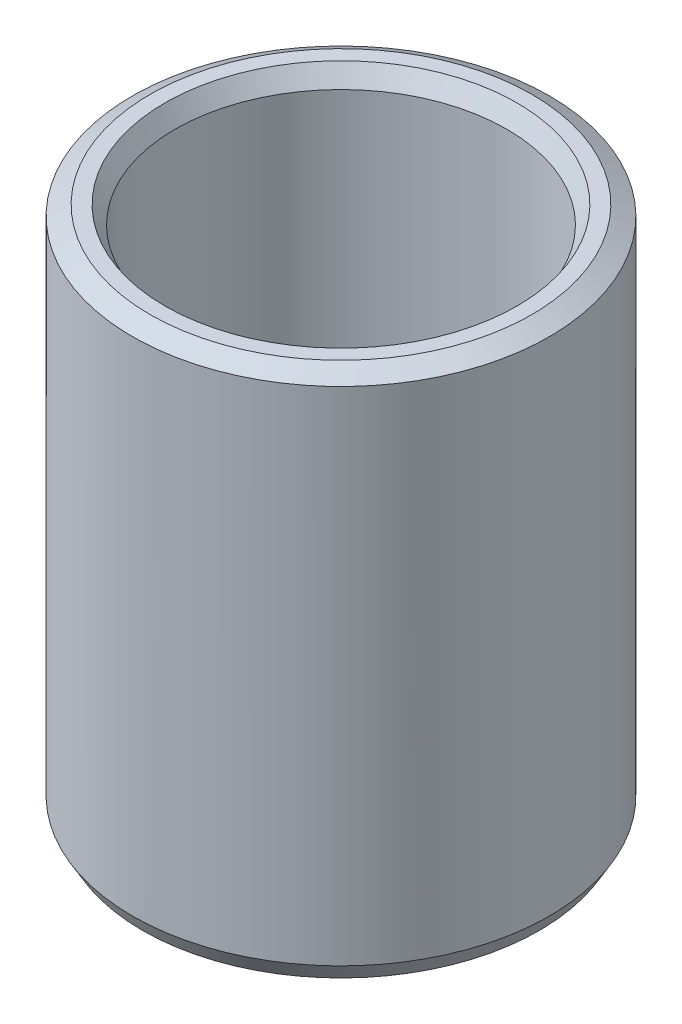
ISO-10303-21;
HEADER;
FILE_DESCRIPTION(('STEP AP214'),'2;1');
FILE_NAME('part.step','',(''),(''),'','','');
FILE_SCHEMA(('AUTOMOTIVE_DESIGN { 1 0 10303 214 1 1 1 1 }'));
ENDSEC;
DATA;
#1=APPLICATION_CONTEXT('core data for automotive mechanical design processes');
#2=APPLICATION_PROTOCOL_DEFINITION('international standard','automotive_design',2000,#1);
#3=PRODUCT_CONTEXT('',#1,'mechanical');
#4=PRODUCT('Part','Part','',(#3));
#5=PRODUCT_RELATED_PRODUCT_CATEGORY('part','',(#4));
#6=PRODUCT_DEFINITION_FORMATION('','',#4);
#7=PRODUCT_DEFINITION_CONTEXT('part definition',#1,'design');
#8=PRODUCT_DEFINITION('design','',#6,#7);
#9=PRODUCT_DEFINITION_SHAPE('','',#8);
#10=(LENGTH_UNIT() NAMED_UNIT(*) SI_UNIT(.MILLI.,.METRE.));
#11=(NAMED_UNIT(*) PLANE_ANGLE_UNIT() SI_UNIT($,.RADIAN.));
#12=(NAMED_UNIT(*) SI_UNIT($,.STERADIAN.) SOLID_ANGLE_UNIT());
#13=UNCERTAINTY_MEASURE_WITH_UNIT(LENGTH_MEASURE(1.E-05),#10,'distance_accuracy_value','');
#14=(GEOMETRIC_REPRESENTATION_CONTEXT(3) GLOBAL_UNCERTAINTY_ASSIGNED_CONTEXT((#13)) GLOBAL_UNIT_ASSIGNED_CONTEXT((#10,
#11,#12)) REPRESENTATION_CONTEXT('',''));
#15=CARTESIAN_POINT('',(0.,0.,0.));
#16=DIRECTION('',(0.,0.,1.));
#17=DIRECTION('',(1.,0.,0.));
#18=AXIS2_PLACEMENT_3D('',#15,#16,#17);
#19=CARTESIAN_POINT('',(0.,114.304376309093,0.));
#20=DIRECTION('',(0.,-1.,0.));
#21=DIRECTION('',(0.,0.,-1.));
#22=AXIS2_PLACEMENT_3D('',#19,#20,#21);
#23=CYLINDRICAL_SURFACE('',#22,45.);
#24=CARTESIAN_POINT('',(0.,3.8169350454051,0.));
#25=DIRECTION('',(0.,1.,0.));
#26=DIRECTION('',(0.,0.,1.));
#27=AXIS2_PLACEMENT_3D('',#24,#25,#26);
#28=CIRCLE('',#27,45.);
#29=CARTESIAN_POINT('',(0.,3.8169350454051,45.));
#30=VERTEX_POINT('',#29);
#31=EDGE_CURVE('E10',#30,#30,#28,.T.);
#32=ORIENTED_EDGE('',*,*,#31,.T.);
#33=EDGE_LOOP('',(#32));
#34=FACE_BOUND('',#33,.T.);
#35=CARTESIAN_POINT('',(0.,112.100667833149,0.));
#36=DIRECTION('',(0.,1.,0.));
#37=DIRECTION('',(0.,0.,1.));
#38=AXIS2_PLACEMENT_3D('',#35,#36,#37);
#39=CIRCLE('',#38,45.);
#40=CARTESIAN_POINT('',(0.,112.100667833149,-45.));
#41=VERTEX_POINT('',#40);
#42=EDGE_CURVE('E50',#41,#41,#39,.F.);
#43=ORIENTED_EDGE('',*,*,#42,.T.);
#44=EDGE_LOOP('',(#43));
#45=FACE_BOUND('',#44,.T.);
#46=ADVANCED_FACE('F39',(#34,#45),#23,.T.);
#47=CARTESIAN_POINT('',(0.,114.304376309093,0.));
#48=DIRECTION('',(0.,1.,0.));
#49=DIRECTION('',(0.,0.,1.));
#50=AXIS2_PLACEMENT_3D('',#47,#48,#49);
#51=PLANE('',#50);
#52=CARTESIAN_POINT('',(0.,114.304376309093,0.));
#53=DIRECTION('',(0.,1.,0.));
#54=DIRECTION('',(0.,0.,1.));
#55=AXIS2_PLACEMENT_3D('',#52,#53,#54);
#56=CIRCLE('',#55,37.9833884102577);
#57=CARTESIAN_POINT('',(0.,114.304376309093,37.9833884102577));
#58=VERTEX_POINT('',#57);
#59=EDGE_CURVE('E58',#58,#58,#56,.F.);
#60=ORIENTED_EDGE('',*,*,#59,.T.);
#61=EDGE_LOOP('',(#60));
#62=FACE_BOUND('',#61,.T.);
#63=CARTESIAN_POINT('',(0.,114.304376309093,0.));
#64=DIRECTION('',(0.,1.,0.));
#65=DIRECTION('',(0.,0.,1.));
#66=AXIS2_PLACEMENT_3D('',#63,#64,#65);
#67=CIRCLE('',#66,41.1830649545949);
#68=CARTESIAN_POINT('',(0.,114.304376309093,-41.1830649545949));
#69=VERTEX_POINT('',#68);
#70=EDGE_CURVE('E61',#69,#69,#67,.T.);
#71=ORIENTED_EDGE('',*,*,#70,.T.);
#72=EDGE_LOOP('',(#71));
#73=FACE_BOUND('',#72,.T.);
#74=ADVANCED_FACE('F88',(#62,#73),#51,.T.);
#75=CARTESIAN_POINT('',(0.,0.,0.));
#76=DIRECTION('',(0.,1.,0.));
#77=DIRECTION('',(0.,0.,1.));
#78=AXIS2_PLACEMENT_3D('',#75,#76,#77);
#79=PLANE('',#78);
#80=CARTESIAN_POINT('',(0.,0.,0.));
#81=DIRECTION('',(0.,1.,0.));
#82=DIRECTION('',(0.,0.,1.));
#83=AXIS2_PLACEMENT_3D('',#80,#81,#82);
#84=CIRCLE('',#83,39.5966149797188);
#85=CARTESIAN_POINT('',(0.,0.,39.5966149797188));
#86=VERTEX_POINT('',#85);
#87=EDGE_CURVE('E51',#86,#86,#84,.T.);
#88=ORIENTED_EDGE('',*,*,#87,.T.);
#89=EDGE_LOOP('',(#88));
#90=FACE_BOUND('',#89,.T.);
#91=CARTESIAN_POINT('',(0.,0.,0.));
#92=DIRECTION('',(0.,1.,0.));
#93=DIRECTION('',(0.,0.,1.));
#94=AXIS2_PLACEMENT_3D('',#91,#92,#93);
#95=CIRCLE('',#94,42.796291524056);
#96=CARTESIAN_POINT('',(0.,0.,42.796291524056));
#97=VERTEX_POINT('',#96);
#98=EDGE_CURVE('E54',#97,#97,#95,.F.);
#99=ORIENTED_EDGE('',*,*,#98,.T.);
#100=EDGE_LOOP('',(#99));
#101=FACE_BOUND('',#100,.T.);
#102=ADVANCED_FACE('F83',(#90,#101),#79,.F.);
#103=CARTESIAN_POINT('',(0.,114.304376309093,0.));
#104=DIRECTION('',(0.,-1.,0.));
#105=DIRECTION('',(0.,0.,-1.));
#106=AXIS2_PLACEMENT_3D('',#103,#104,#105);
#107=CYLINDRICAL_SURFACE('',#106,35.7796799343137);
#108=CARTESIAN_POINT('',(0.,110.487441263688,0.));
#109=DIRECTION('',(0.,1.,0.));
#110=DIRECTION('',(0.,0.,1.));
#111=AXIS2_PLACEMENT_3D('',#108,#109,#110);
#112=CIRCLE('',#111,35.7796799343137);
#113=CARTESIAN_POINT('',(0.,110.487441263688,35.7796799343137));
#114=VERTEX_POINT('',#113);
#115=EDGE_CURVE('E67',#114,#114,#112,.T.);
#116=ORIENTED_EDGE('',*,*,#115,.T.);
#117=EDGE_LOOP('',(#116));
#118=FACE_BOUND('',#117,.T.);
#119=CARTESIAN_POINT('',(0.,2.20370847594395,0.));
#120=DIRECTION('',(0.,1.,0.));
#121=DIRECTION('',(0.,0.,1.));
#122=AXIS2_PLACEMENT_3D('',#119,#120,#121);
#123=CIRCLE('',#122,35.7796799343137);
#124=CARTESIAN_POINT('',(0.,2.20370847594395,35.7796799343137));
#125=VERTEX_POINT('',#124);
#126=EDGE_CURVE('E69',#125,#125,#123,.F.);
#127=ORIENTED_EDGE('',*,*,#126,.T.);
#128=EDGE_LOOP('',(#127));
#129=FACE_BOUND('',#128,.T.);
#130=ADVANCED_FACE('F71',(#118,#129),#107,.F.);
#131=CARTESIAN_POINT('',(0.,110.487441263688,0.));
#132=DIRECTION('',(0.,1.,0.));
#133=DIRECTION('',(0.,0.,1.));
#134=AXIS2_PLACEMENT_3D('',#131,#132,#133);
#135=CONICAL_SURFACE('',#134,35.7796799343137,0.523598775598309);
#136=ORIENTED_EDGE('',*,*,#59,.F.);
#137=EDGE_LOOP('',(#136));
#138=FACE_BOUND('',#137,.T.);
#139=ORIENTED_EDGE('',*,*,#115,.F.);
#140=EDGE_LOOP('',(#139));
#141=FACE_BOUND('',#140,.T.);
#142=ADVANCED_FACE('F77',(#138,#141),#135,.F.);
#143=CARTESIAN_POINT('',(0.,0.,0.));
#144=DIRECTION('',(0.,-1.,0.));
#145=DIRECTION('',(0.,0.,-1.));
#146=AXIS2_PLACEMENT_3D('',#143,#144,#145);
#147=CONICAL_SURFACE('',#146,39.5966149797188,1.0471975511966);
#148=ORIENTED_EDGE('',*,*,#126,.F.);
#149=EDGE_LOOP('',(#148));
#150=FACE_BOUND('',#149,.T.);
#151=ORIENTED_EDGE('',*,*,#87,.F.);
#152=EDGE_LOOP('',(#151));
#153=FACE_BOUND('',#152,.T.);
#154=ADVANCED_FACE('F73',(#150,#153),#147,.F.);
#155=CARTESIAN_POINT('',(0.,3.8169350454051,0.));
#156=DIRECTION('',(0.,1.,0.));
#157=DIRECTION('',(0.,0.,1.));
#158=AXIS2_PLACEMENT_3D('',#155,#156,#157);
#159=CONICAL_SURFACE('',#158,45.,0.523598775598301);
#160=ORIENTED_EDGE('',*,*,#98,.F.);
#161=EDGE_LOOP('',(#160));
#162=FACE_BOUND('',#161,.T.);
#163=ORIENTED_EDGE('',*,*,#31,.F.);
#164=EDGE_LOOP('',(#163));
#165=FACE_BOUND('',#164,.T.);
#166=ADVANCED_FACE('F76',(#162,#165),#159,.T.);
#167=CARTESIAN_POINT('',(0.,114.304376309093,0.));
#168=DIRECTION('',(0.,-1.,0.));
#169=DIRECTION('',(0.,0.,-1.));
#170=AXIS2_PLACEMENT_3D('',#167,#168,#169);
#171=CONICAL_SURFACE('',#170,41.1830649545949,1.0471975511966);
#172=CARTESIAN_POINT('',(0.,112.100667833149,-45.));
#173=CARTESIAN_POINT('',(0.,112.123623129774,-44.9602402599437));
#174=CARTESIAN_POINT('',(0.,112.146578426398,-44.9204805198874));
#175=CARTESIAN_POINT('',(0.,112.192489019647,-44.8409610397748));
#176=CARTESIAN_POINT('',(0.,112.215444316271,-44.8012012997185));
#177=CARTESIAN_POINT('',(0.,112.26135490952,-44.7216818196059));
#178=CARTESIAN_POINT('',(0.,112.284310206145,-44.6819220795496));
#179=CARTESIAN_POINT('',(0.,112.330220799394,-44.602402599437));
#180=CARTESIAN_POINT('',(0.,112.353176096018,-44.5626428593807));
#181=CARTESIAN_POINT('',(0.,112.399086689267,-44.4831233792681));
#182=CARTESIAN_POINT('',(0.,112.422041985891,-44.4433636392118));
#183=CARTESIAN_POINT('',(0.,112.46795257914,-44.3638441590992));
#184=CARTESIAN_POINT('',(0.,112.490907875764,-44.3240844190429));
#185=CARTESIAN_POINT('',(0.,112.536818469013,-44.2445649389303));
#186=CARTESIAN_POINT('',(0.,112.559773765638,-44.2048051988739));
#187=CARTESIAN_POINT('',(0.,112.605684358887,-44.1252857187613));
#188=CARTESIAN_POINT('',(0.,112.628639655511,-44.085525978705));
#189=CARTESIAN_POINT('',(0.,112.67455024876,-44.0060064985924));
#190=CARTESIAN_POINT('',(0.,112.697505545384,-43.9662467585361));
#191=CARTESIAN_POINT('',(0.,112.743416138633,-43.8867272784235));
#192=CARTESIAN_POINT('',(0.,112.766371435257,-43.8469675383672));
#193=CARTESIAN_POINT('',(0.,112.812282028506,-43.7674480582546));
#194=CARTESIAN_POINT('',(0.,112.835237325131,-43.7276883181983));
#195=CARTESIAN_POINT('',(0.,112.88114791838,-43.6481688380857));
#196=CARTESIAN_POINT('',(0.,112.904103215004,-43.6084090980294));
#197=CARTESIAN_POINT('',(0.,112.950013808253,-43.5288896179168));
#198=CARTESIAN_POINT('',(0.,112.972969104877,-43.4891298778605));
#199=CARTESIAN_POINT('',(0.,113.018879698126,-43.4096103977479));
#200=CARTESIAN_POINT('',(0.,113.04183499475,-43.3698506576916));
#201=CARTESIAN_POINT('',(0.,113.087745587999,-43.290331177579));
#202=CARTESIAN_POINT('',(0.,113.110700884624,-43.2505714375227));
#203=CARTESIAN_POINT('',(0.,113.156611477873,-43.1710519574101));
#204=CARTESIAN_POINT('',(0.,113.179566774497,-43.1312922173538));
#205=CARTESIAN_POINT('',(0.,113.225477367746,-43.0517727372412));
#206=CARTESIAN_POINT('',(0.,113.24843266437,-43.0120129971849));
#207=CARTESIAN_POINT('',(0.,113.294343257619,-42.9324935170723));
#208=CARTESIAN_POINT('',(0.,113.317298554243,-42.8927337770159));
#209=CARTESIAN_POINT('',(0.,113.363209147492,-42.8132142969033));
#210=CARTESIAN_POINT('',(0.,113.386164444117,-42.773454556847));
#211=CARTESIAN_POINT('',(0.,113.432075037366,-42.6939350767344));
#212=CARTESIAN_POINT('',(0.,113.45503033399,-42.6541753366781));
#213=CARTESIAN_POINT('',(0.,113.500940927239,-42.5746558565655));
#214=CARTESIAN_POINT('',(0.,113.523896223863,-42.5348961165092));
#215=CARTESIAN_POINT('',(0.,113.569806817112,-42.4553766363966));
#216=CARTESIAN_POINT('',(0.,113.592762113736,-42.4156168963403));
#217=CARTESIAN_POINT('',(0.,113.638672706985,-42.3360974162277));
#218=CARTESIAN_POINT('',(0.,113.66162800361,-42.2963376761714));
#219=CARTESIAN_POINT('',(0.,113.707538596858,-42.2168181960588));
#220=CARTESIAN_POINT('',(0.,113.730493893483,-42.1770584560025));
#221=CARTESIAN_POINT('',(0.,113.776404486732,-42.0975389758899));
#222=CARTESIAN_POINT('',(0.,113.799359783356,-42.0577792358336));
#223=CARTESIAN_POINT('',(0.,113.845270376605,-41.978259755721));
#224=CARTESIAN_POINT('',(0.,113.868225673229,-41.9385000156647));
#225=CARTESIAN_POINT('',(0.,113.914136266478,-41.8589805355521));
#226=CARTESIAN_POINT('',(0.,113.937091563103,-41.8192207954958));
#227=CARTESIAN_POINT('',(0.,113.983002156352,-41.7397013153832));
#228=CARTESIAN_POINT('',(0.,114.005957452976,-41.6999415753268));
#229=CARTESIAN_POINT('',(0.,114.051868046225,-41.6204220952142));
#230=CARTESIAN_POINT('',(0.,114.074823342849,-41.5806623551579));
#231=CARTESIAN_POINT('',(0.,114.120733936098,-41.5011428750453));
#232=CARTESIAN_POINT('',(0.,114.143689232722,-41.461383134989));
#233=CARTESIAN_POINT('',(0.,114.189599825971,-41.3818636548764));
#234=CARTESIAN_POINT('',(0.,114.212555122596,-41.3421039148201));
#235=CARTESIAN_POINT('',(0.,114.258465715844,-41.2625844347075));
#236=CARTESIAN_POINT('',(0.,114.281421012469,-41.2228246946512));
#237=CARTESIAN_POINT('',(0.,114.304376309093,-41.1830649545949));
#238=B_SPLINE_CURVE_WITH_KNOTS('',3,(#172,#173,#174,#175,#176,#177,#178,#179,#180,#181,#182,
#183,#184,#185,#186,#187,#188,#189,#190,#191,#192,#193,#194,#195,#196,#197,#198,#199,#200,#201,
#202,#203,#204,#205,#206,#207,#208,#209,#210,#211,#212,#213,#214,#215,#216,#217,#218,#219,#220,
#221,#222,#223,#224,#225,#226,#227,#228,#229,#230,#231,#232,#233,#234,#235,#236,#237),
.UNSPECIFIED.,.F.,.F.,(4,2,2,2,2,2,2,2,2,2,2,2,2,2,2,2,2,2,2,2,2,2,2,2,2,2,2,2,2,2,2,2,4),(0.,
0.137731779746504,0.275463559493001,0.413195339239497,0.550927118985988,0.688658898732492,
0.826390678478989,0.964122458225486,1.10185423797198,1.23958601771848,1.37731779746498,
1.51504957721147,1.65278135695797,1.79051313670447,1.92824491645097,2.06597669619747,
2.20370847594397,2.34144025569046,2.47917203543695,2.61690381518346,2.75463559492995,
2.89236737467645,3.03009915442295,3.16783093416945,3.30556271391594,3.44329449366244,
3.58102627340894,3.71875805315543,3.85648983290194,3.99422161264843,4.13195339239493,
4.26968517214142,4.40741695188792),.UNSPECIFIED.);
#239=EDGE_CURVE('BSEAM45',#41,#69,#238,.T.);
#240=ORIENTED_EDGE('',*,*,#42,.F.);
#241=ORIENTED_EDGE('',*,*,#70,.F.);
#242=ORIENTED_EDGE('',*,*,#239,.T.);
#243=ORIENTED_EDGE('',*,*,#239,.F.);
#244=EDGE_LOOP('',(#240,#242,#241,#243));
#245=FACE_BOUND('',#244,.T.);
#246=ADVANCED_FACE('F45',(#245),#171,.T.);
#247=CLOSED_SHELL('',(#46,#74,#102,#130,#142,#154,#166,#246));
#248=MANIFOLD_SOLID_BREP('B2',#247);
#249=ADVANCED_BREP_SHAPE_REPRESENTATION('',(#18,#248),#14);
#250=SHAPE_DEFINITION_REPRESENTATION(#9,#249);
ENDSEC;
END-ISO-10303-21;
